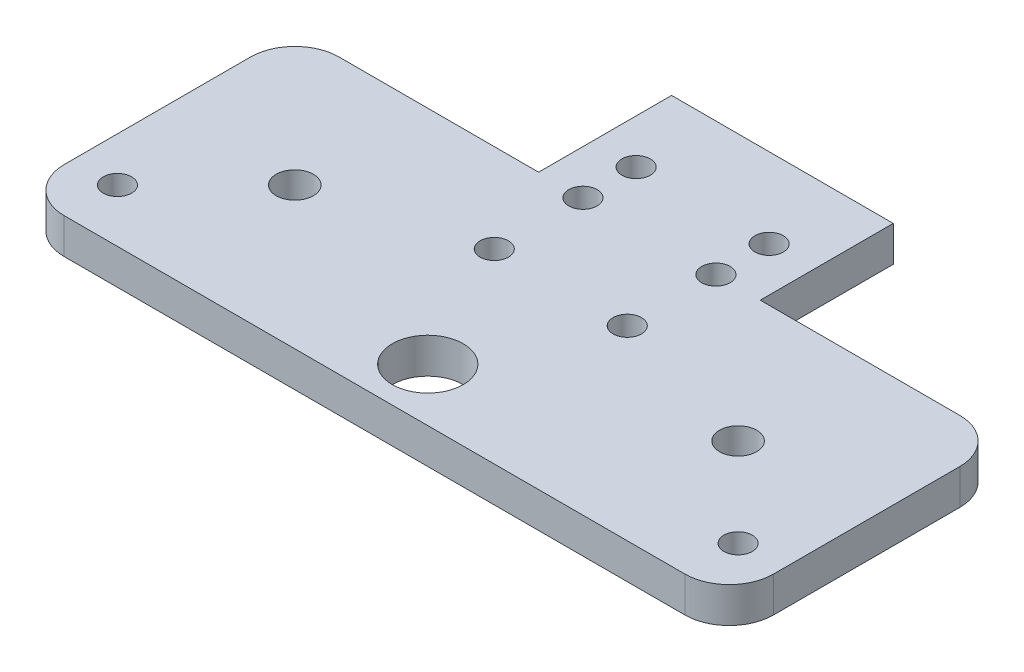
ISO-10303-21;
HEADER;
FILE_DESCRIPTION(('STEP AP214'),'2;1');
FILE_NAME('part.step','',(''),(''),'','','');
FILE_SCHEMA(('AUTOMOTIVE_DESIGN { 1 0 10303 214 1 1 1 1 }'));
ENDSEC;
DATA;
#1=APPLICATION_CONTEXT('core data for automotive mechanical design processes');
#2=APPLICATION_PROTOCOL_DEFINITION('international standard','automotive_design',2000,#1);
#3=PRODUCT_CONTEXT('',#1,'mechanical');
#4=PRODUCT('Part','Part','',(#3));
#5=PRODUCT_RELATED_PRODUCT_CATEGORY('part','',(#4));
#6=PRODUCT_DEFINITION_FORMATION('','',#4);
#7=PRODUCT_DEFINITION_CONTEXT('part definition',#1,'design');
#8=PRODUCT_DEFINITION('design','',#6,#7);
#9=PRODUCT_DEFINITION_SHAPE('','',#8);
#10=(LENGTH_UNIT() NAMED_UNIT(*) SI_UNIT(.MILLI.,.METRE.));
#11=(NAMED_UNIT(*) PLANE_ANGLE_UNIT() SI_UNIT($,.RADIAN.));
#12=(NAMED_UNIT(*) SI_UNIT($,.STERADIAN.) SOLID_ANGLE_UNIT());
#13=UNCERTAINTY_MEASURE_WITH_UNIT(LENGTH_MEASURE(1.E-05),#10,'distance_accuracy_value','');
#14=(GEOMETRIC_REPRESENTATION_CONTEXT(3) GLOBAL_UNCERTAINTY_ASSIGNED_CONTEXT((#13)) GLOBAL_UNIT_ASSIGNED_CONTEXT((#10,
#11,#12)) REPRESENTATION_CONTEXT('',''));
#15=CARTESIAN_POINT('',(0.,0.,0.));
#16=DIRECTION('',(0.,0.,1.));
#17=DIRECTION('',(1.,0.,0.));
#18=AXIS2_PLACEMENT_3D('',#15,#16,#17);
#19=CARTESIAN_POINT('',(-35.,4.,21.));
#20=DIRECTION('',(0.,1.,0.));
#21=DIRECTION('',(0.,0.,1.));
#22=AXIS2_PLACEMENT_3D('',#19,#20,#21);
#23=PLANE('',#22);
#24=CARTESIAN_POINT('',(-25.,4.,10.));
#25=DIRECTION('',(0.,1.,0.));
#26=DIRECTION('',(0.,0.,1.));
#27=AXIS2_PLACEMENT_3D('',#24,#25,#26);
#28=CIRCLE('',#27,2.1);
#29=CARTESIAN_POINT('',(-25.,4.,12.1));
#30=VERTEX_POINT('',#29);
#31=EDGE_CURVE('E319',#30,#30,#28,.T.);
#32=ORIENTED_EDGE('',*,*,#31,.F.);
#33=EDGE_LOOP('',(#32));
#34=FACE_BOUND('',#33,.T.);
#35=CARTESIAN_POINT('',(35.,4.,20.));
#36=DIRECTION('',(0.,1.,0.));
#37=DIRECTION('',(0.,0.,1.));
#38=AXIS2_PLACEMENT_3D('',#35,#36,#37);
#39=CIRCLE('',#38,1.6);
#40=CARTESIAN_POINT('',(35.,4.,21.6));
#41=VERTEX_POINT('',#40);
#42=EDGE_CURVE('E331',#41,#41,#39,.T.);
#43=ORIENTED_EDGE('',*,*,#42,.F.);
#44=EDGE_LOOP('',(#43));
#45=FACE_BOUND('',#44,.T.);
#46=CARTESIAN_POINT('',(7.5,4.,-5.));
#47=DIRECTION('',(0.,1.,0.));
#48=DIRECTION('',(0.,0.,1.));
#49=AXIS2_PLACEMENT_3D('',#46,#47,#48);
#50=CIRCLE('',#49,1.6);
#51=CARTESIAN_POINT('',(7.5,4.,-3.4));
#52=VERTEX_POINT('',#51);
#53=EDGE_CURVE('E343',#52,#52,#50,.T.);
#54=ORIENTED_EDGE('',*,*,#53,.F.);
#55=EDGE_LOOP('',(#54));
#56=FACE_BOUND('',#55,.T.);
#57=CARTESIAN_POINT('',(7.5,4.,5.));
#58=DIRECTION('',(0.,1.,0.));
#59=DIRECTION('',(0.,0.,1.));
#60=AXIS2_PLACEMENT_3D('',#57,#58,#59);
#61=CIRCLE('',#60,1.6);
#62=CARTESIAN_POINT('',(7.5,4.,6.6));
#63=VERTEX_POINT('',#62);
#64=EDGE_CURVE('E355',#63,#63,#61,.T.);
#65=ORIENTED_EDGE('',*,*,#64,.F.);
#66=EDGE_LOOP('',(#65));
#67=FACE_BOUND('',#66,.T.);
#68=CARTESIAN_POINT('',(7.5,4.,-11.));
#69=DIRECTION('',(0.,1.,0.));
#70=DIRECTION('',(0.,0.,1.));
#71=AXIS2_PLACEMENT_3D('',#68,#69,#70);
#72=CIRCLE('',#71,1.6);
#73=CARTESIAN_POINT('',(7.5,4.,-9.4));
#74=VERTEX_POINT('',#73);
#75=EDGE_CURVE('E367',#74,#74,#72,.T.);
#76=ORIENTED_EDGE('',*,*,#75,.F.);
#77=EDGE_LOOP('',(#76));
#78=FACE_BOUND('',#77,.T.);
#79=CARTESIAN_POINT('',(-35.,4.,21.));
#80=DIRECTION('',(0.,1.,0.));
#81=DIRECTION('',(0.,0.,1.));
#82=AXIS2_PLACEMENT_3D('',#79,#80,#81);
#83=CIRCLE('',#82,5.);
#84=CARTESIAN_POINT('',(-40.,4.,21.));
#85=VERTEX_POINT('',#84);
#86=CARTESIAN_POINT('',(-35.,4.,26.));
#87=VERTEX_POINT('',#86);
#88=EDGE_CURVE('E177',#85,#87,#83,.T.);
#89=ORIENTED_EDGE('',*,*,#88,.T.);
#90=DIRECTION('',(1.,0.,0.));
#91=VECTOR('',#90,1.);
#92=CARTESIAN_POINT('',(-35.,4.,26.));
#93=LINE('',#92,#91);
#94=CARTESIAN_POINT('',(35.,4.,26.));
#95=VERTEX_POINT('',#94);
#96=EDGE_CURVE('E105',#87,#95,#93,.T.);
#97=ORIENTED_EDGE('',*,*,#96,.T.);
#98=CARTESIAN_POINT('',(35.,4.,21.));
#99=DIRECTION('',(0.,1.,0.));
#100=DIRECTION('',(0.,0.,1.));
#101=AXIS2_PLACEMENT_3D('',#98,#99,#100);
#102=CIRCLE('',#101,5.);
#103=CARTESIAN_POINT('',(40.,4.,21.));
#104=VERTEX_POINT('',#103);
#105=EDGE_CURVE('E204',#95,#104,#102,.T.);
#106=ORIENTED_EDGE('',*,*,#105,.T.);
#107=DIRECTION('',(0.,0.,-1.));
#108=VECTOR('',#107,1.);
#109=CARTESIAN_POINT('',(40.,4.,21.));
#110=LINE('',#109,#108);
#111=CARTESIAN_POINT('',(40.,4.,0.));
#112=VERTEX_POINT('',#111);
#113=EDGE_CURVE('E223',#104,#112,#110,.T.);
#114=ORIENTED_EDGE('',*,*,#113,.T.);
#115=CARTESIAN_POINT('',(35.,4.,0.));
#116=DIRECTION('',(0.,1.,0.));
#117=DIRECTION('',(0.,0.,1.));
#118=AXIS2_PLACEMENT_3D('',#115,#116,#117);
#119=CIRCLE('',#118,5.);
#120=CARTESIAN_POINT('',(35.,4.,-5.));
#121=VERTEX_POINT('',#120);
#122=EDGE_CURVE('E220',#112,#121,#119,.T.);
#123=ORIENTED_EDGE('',*,*,#122,.T.);
#124=DIRECTION('',(-1.,0.,0.));
#125=VECTOR('',#124,1.);
#126=CARTESIAN_POINT('',(35.,4.,-5.));
#127=LINE('',#126,#125);
#128=CARTESIAN_POINT('',(12.5,4.,-5.));
#129=VERTEX_POINT('',#128);
#130=EDGE_CURVE('E222',#121,#129,#127,.T.);
#131=ORIENTED_EDGE('',*,*,#130,.T.);
#132=DIRECTION('',(0.,0.,-1.));
#133=VECTOR('',#132,1.);
#134=CARTESIAN_POINT('',(12.5,4.,-5.));
#135=LINE('',#134,#133);
#136=CARTESIAN_POINT('',(12.5,4.,-20.));
#137=VERTEX_POINT('',#136);
#138=EDGE_CURVE('E225',#129,#137,#135,.T.);
#139=ORIENTED_EDGE('',*,*,#138,.T.);
#140=DIRECTION('',(-1.,0.,0.));
#141=VECTOR('',#140,1.);
#142=CARTESIAN_POINT('',(12.5,4.,-20.));
#143=LINE('',#142,#141);
#144=CARTESIAN_POINT('',(-12.5,4.,-20.));
#145=VERTEX_POINT('',#144);
#146=EDGE_CURVE('E231',#137,#145,#143,.T.);
#147=ORIENTED_EDGE('',*,*,#146,.T.);
#148=DIRECTION('',(0.,0.,1.));
#149=VECTOR('',#148,1.);
#150=CARTESIAN_POINT('',(-12.5,4.,-20.));
#151=LINE('',#150,#149);
#152=CARTESIAN_POINT('',(-12.5,4.,-5.));
#153=VERTEX_POINT('',#152);
#154=EDGE_CURVE('E136',#145,#153,#151,.T.);
#155=ORIENTED_EDGE('',*,*,#154,.T.);
#156=DIRECTION('',(-1.,0.,0.));
#157=VECTOR('',#156,1.);
#158=CARTESIAN_POINT('',(-12.5,4.,-5.));
#159=LINE('',#158,#157);
#160=CARTESIAN_POINT('',(-35.,4.,-5.));
#161=VERTEX_POINT('',#160);
#162=EDGE_CURVE('E130',#153,#161,#159,.T.);
#163=ORIENTED_EDGE('',*,*,#162,.T.);
#164=CARTESIAN_POINT('',(-35.,4.,0.));
#165=DIRECTION('',(0.,1.,0.));
#166=DIRECTION('',(0.,0.,1.));
#167=AXIS2_PLACEMENT_3D('',#164,#165,#166);
#168=CIRCLE('',#167,5.);
#169=CARTESIAN_POINT('',(-40.,4.,0.));
#170=VERTEX_POINT('',#169);
#171=EDGE_CURVE('E134',#161,#170,#168,.T.);
#172=ORIENTED_EDGE('',*,*,#171,.T.);
#173=DIRECTION('',(0.,0.,1.));
#174=VECTOR('',#173,1.);
#175=CARTESIAN_POINT('',(-40.,4.,0.));
#176=LINE('',#175,#174);
#177=EDGE_CURVE('E50',#170,#85,#176,.T.);
#178=ORIENTED_EDGE('',*,*,#177,.T.);
#179=EDGE_LOOP('',(#89,#97,#106,#114,#123,#131,#139,#147,#155,#163,#172,#178));
#180=FACE_BOUND('',#179,.T.);
#181=CARTESIAN_POINT('',(-7.5,4.,-11.));
#182=DIRECTION('',(0.,1.,0.));
#183=DIRECTION('',(0.,0.,1.));
#184=AXIS2_PLACEMENT_3D('',#181,#182,#183);
#185=CIRCLE('',#184,1.6);
#186=CARTESIAN_POINT('',(-7.5,4.,-9.4));
#187=VERTEX_POINT('',#186);
#188=EDGE_CURVE('E158',#187,#187,#185,.T.);
#189=ORIENTED_EDGE('',*,*,#188,.F.);
#190=EDGE_LOOP('',(#189));
#191=FACE_BOUND('',#190,.T.);
#192=CARTESIAN_POINT('',(-7.5,4.,5.));
#193=DIRECTION('',(0.,1.,0.));
#194=DIRECTION('',(0.,0.,1.));
#195=AXIS2_PLACEMENT_3D('',#192,#193,#194);
#196=CIRCLE('',#195,1.6);
#197=CARTESIAN_POINT('',(-7.5,4.,6.6));
#198=VERTEX_POINT('',#197);
#199=EDGE_CURVE('E361',#198,#198,#196,.T.);
#200=ORIENTED_EDGE('',*,*,#199,.F.);
#201=EDGE_LOOP('',(#200));
#202=FACE_BOUND('',#201,.T.);
#203=CARTESIAN_POINT('',(-7.5,4.,-5.));
#204=DIRECTION('',(0.,1.,0.));
#205=DIRECTION('',(0.,0.,1.));
#206=AXIS2_PLACEMENT_3D('',#203,#204,#205);
#207=CIRCLE('',#206,1.6);
#208=CARTESIAN_POINT('',(-7.5,4.,-3.4));
#209=VERTEX_POINT('',#208);
#210=EDGE_CURVE('E349',#209,#209,#207,.T.);
#211=ORIENTED_EDGE('',*,*,#210,.F.);
#212=EDGE_LOOP('',(#211));
#213=FACE_BOUND('',#212,.T.);
#214=CARTESIAN_POINT('',(-35.,4.,20.));
#215=DIRECTION('',(0.,1.,0.));
#216=DIRECTION('',(0.,0.,1.));
#217=AXIS2_PLACEMENT_3D('',#214,#215,#216);
#218=CIRCLE('',#217,1.6);
#219=CARTESIAN_POINT('',(-35.,4.,21.6));
#220=VERTEX_POINT('',#219);
#221=EDGE_CURVE('E337',#220,#220,#218,.T.);
#222=ORIENTED_EDGE('',*,*,#221,.F.);
#223=EDGE_LOOP('',(#222));
#224=FACE_BOUND('',#223,.T.);
#225=CARTESIAN_POINT('',(25.,4.,10.));
#226=DIRECTION('',(0.,1.,0.));
#227=DIRECTION('',(0.,0.,-1.));
#228=AXIS2_PLACEMENT_3D('',#225,#226,#227);
#229=CIRCLE('',#228,2.1);
#230=CARTESIAN_POINT('',(25.,4.,7.9));
#231=VERTEX_POINT('',#230);
#232=EDGE_CURVE('E325',#231,#231,#229,.T.);
#233=ORIENTED_EDGE('',*,*,#232,.F.);
#234=EDGE_LOOP('',(#233));
#235=FACE_BOUND('',#234,.T.);
#236=CARTESIAN_POINT('',(0.,4.,20.));
#237=DIRECTION('',(0.,1.,0.));
#238=DIRECTION('',(0.,0.,1.));
#239=AXIS2_PLACEMENT_3D('',#236,#237,#238);
#240=CIRCLE('',#239,4.);
#241=CARTESIAN_POINT('',(0.,4.,24.));
#242=VERTEX_POINT('',#241);
#243=EDGE_CURVE('E310',#242,#242,#240,.T.);
#244=ORIENTED_EDGE('',*,*,#243,.F.);
#245=EDGE_LOOP('',(#244));
#246=FACE_BOUND('',#245,.T.);
#247=ADVANCED_FACE('F33',(#34,#45,#56,#67,#78,#180,#191,#202,#213,#224,#235,#246),#23,.T.);
#248=CARTESIAN_POINT('',(-35.,0.,21.));
#249=DIRECTION('',(0.,1.,0.));
#250=DIRECTION('',(0.,0.,1.));
#251=AXIS2_PLACEMENT_3D('',#248,#249,#250);
#252=PLANE('',#251);
#253=CARTESIAN_POINT('',(-35.,0.,21.));
#254=DIRECTION('',(0.,1.,0.));
#255=DIRECTION('',(0.,0.,1.));
#256=AXIS2_PLACEMENT_3D('',#253,#254,#255);
#257=CIRCLE('',#256,5.);
#258=CARTESIAN_POINT('',(-40.,0.,21.));
#259=VERTEX_POINT('',#258);
#260=CARTESIAN_POINT('',(-35.,0.,26.));
#261=VERTEX_POINT('',#260);
#262=EDGE_CURVE('E154',#259,#261,#257,.T.);
#263=ORIENTED_EDGE('',*,*,#262,.F.);
#264=DIRECTION('',(0.,0.,1.));
#265=VECTOR('',#264,1.);
#266=CARTESIAN_POINT('',(-40.,0.,0.));
#267=LINE('',#266,#265);
#268=CARTESIAN_POINT('',(-40.,0.,0.));
#269=VERTEX_POINT('',#268);
#270=EDGE_CURVE('E97',#269,#259,#267,.T.);
#271=ORIENTED_EDGE('',*,*,#270,.F.);
#272=CARTESIAN_POINT('',(-35.,0.,0.));
#273=DIRECTION('',(0.,1.,0.));
#274=DIRECTION('',(0.,0.,1.));
#275=AXIS2_PLACEMENT_3D('',#272,#273,#274);
#276=CIRCLE('',#275,5.);
#277=CARTESIAN_POINT('',(-35.,0.,-5.));
#278=VERTEX_POINT('',#277);
#279=EDGE_CURVE('E91',#278,#269,#276,.T.);
#280=ORIENTED_EDGE('',*,*,#279,.F.);
#281=DIRECTION('',(-1.,0.,0.));
#282=VECTOR('',#281,1.);
#283=CARTESIAN_POINT('',(-12.5,0.,-5.));
#284=LINE('',#283,#282);
#285=CARTESIAN_POINT('',(-12.5,0.,-5.));
#286=VERTEX_POINT('',#285);
#287=EDGE_CURVE('E144',#286,#278,#284,.T.);
#288=ORIENTED_EDGE('',*,*,#287,.F.);
#289=DIRECTION('',(0.,0.,1.));
#290=VECTOR('',#289,1.);
#291=CARTESIAN_POINT('',(-12.5,0.,-20.));
#292=LINE('',#291,#290);
#293=CARTESIAN_POINT('',(-12.5,0.,-20.));
#294=VERTEX_POINT('',#293);
#295=EDGE_CURVE('E172',#294,#286,#292,.T.);
#296=ORIENTED_EDGE('',*,*,#295,.F.);
#297=DIRECTION('',(-1.,0.,0.));
#298=VECTOR('',#297,1.);
#299=CARTESIAN_POINT('',(12.5,0.,-20.));
#300=LINE('',#299,#298);
#301=CARTESIAN_POINT('',(12.5,0.,-20.));
#302=VERTEX_POINT('',#301);
#303=EDGE_CURVE('E170',#302,#294,#300,.T.);
#304=ORIENTED_EDGE('',*,*,#303,.F.);
#305=DIRECTION('',(0.,0.,-1.));
#306=VECTOR('',#305,1.);
#307=CARTESIAN_POINT('',(12.5,0.,-5.));
#308=LINE('',#307,#306);
#309=CARTESIAN_POINT('',(12.5,0.,-5.));
#310=VERTEX_POINT('',#309);
#311=EDGE_CURVE('E168',#310,#302,#308,.T.);
#312=ORIENTED_EDGE('',*,*,#311,.F.);
#313=DIRECTION('',(-1.,0.,0.));
#314=VECTOR('',#313,1.);
#315=CARTESIAN_POINT('',(35.,0.,-5.));
#316=LINE('',#315,#314);
#317=CARTESIAN_POINT('',(35.,0.,-5.));
#318=VERTEX_POINT('',#317);
#319=EDGE_CURVE('E166',#318,#310,#316,.T.);
#320=ORIENTED_EDGE('',*,*,#319,.F.);
#321=CARTESIAN_POINT('',(35.,0.,0.));
#322=DIRECTION('',(0.,1.,0.));
#323=DIRECTION('',(0.,0.,1.));
#324=AXIS2_PLACEMENT_3D('',#321,#322,#323);
#325=CIRCLE('',#324,5.);
#326=CARTESIAN_POINT('',(40.,0.,0.));
#327=VERTEX_POINT('',#326);
#328=EDGE_CURVE('E164',#327,#318,#325,.T.);
#329=ORIENTED_EDGE('',*,*,#328,.F.);
#330=DIRECTION('',(0.,0.,-1.));
#331=VECTOR('',#330,1.);
#332=CARTESIAN_POINT('',(40.,0.,21.));
#333=LINE('',#332,#331);
#334=CARTESIAN_POINT('',(40.,0.,21.));
#335=VERTEX_POINT('',#334);
#336=EDGE_CURVE('E162',#335,#327,#333,.T.);
#337=ORIENTED_EDGE('',*,*,#336,.F.);
#338=CARTESIAN_POINT('',(35.,0.,21.));
#339=DIRECTION('',(0.,1.,0.));
#340=DIRECTION('',(0.,0.,1.));
#341=AXIS2_PLACEMENT_3D('',#338,#339,#340);
#342=CIRCLE('',#341,5.);
#343=CARTESIAN_POINT('',(35.,0.,26.));
#344=VERTEX_POINT('',#343);
#345=EDGE_CURVE('E160',#344,#335,#342,.T.);
#346=ORIENTED_EDGE('',*,*,#345,.F.);
#347=DIRECTION('',(1.,0.,0.));
#348=VECTOR('',#347,1.);
#349=CARTESIAN_POINT('',(-35.,0.,26.));
#350=LINE('',#349,#348);
#351=EDGE_CURVE('E157',#261,#344,#350,.T.);
#352=ORIENTED_EDGE('',*,*,#351,.F.);
#353=EDGE_LOOP('',(#263,#271,#280,#288,#296,#304,#312,#320,#329,#337,#346,#352));
#354=FACE_BOUND('',#353,.T.);
#355=CARTESIAN_POINT('',(-7.5,0.,-11.));
#356=DIRECTION('',(0.,1.,0.));
#357=DIRECTION('',(0.,0.,1.));
#358=AXIS2_PLACEMENT_3D('',#355,#356,#357);
#359=CIRCLE('',#358,1.6);
#360=CARTESIAN_POINT('',(-7.5,0.,-9.4));
#361=VERTEX_POINT('',#360);
#362=EDGE_CURVE('E370',#361,#361,#359,.T.);
#363=ORIENTED_EDGE('',*,*,#362,.T.);
#364=EDGE_LOOP('',(#363));
#365=FACE_BOUND('',#364,.T.);
#366=CARTESIAN_POINT('',(7.5,0.,-11.));
#367=DIRECTION('',(0.,1.,0.));
#368=DIRECTION('',(0.,0.,1.));
#369=AXIS2_PLACEMENT_3D('',#366,#367,#368);
#370=CIRCLE('',#369,1.6);
#371=CARTESIAN_POINT('',(7.5,0.,-9.4));
#372=VERTEX_POINT('',#371);
#373=EDGE_CURVE('E364',#372,#372,#370,.T.);
#374=ORIENTED_EDGE('',*,*,#373,.T.);
#375=EDGE_LOOP('',(#374));
#376=FACE_BOUND('',#375,.T.);
#377=CARTESIAN_POINT('',(-7.5,0.,5.));
#378=DIRECTION('',(0.,1.,0.));
#379=DIRECTION('',(0.,0.,1.));
#380=AXIS2_PLACEMENT_3D('',#377,#378,#379);
#381=CIRCLE('',#380,1.6);
#382=CARTESIAN_POINT('',(-7.5,0.,6.6));
#383=VERTEX_POINT('',#382);
#384=EDGE_CURVE('E358',#383,#383,#381,.T.);
#385=ORIENTED_EDGE('',*,*,#384,.T.);
#386=EDGE_LOOP('',(#385));
#387=FACE_BOUND('',#386,.T.);
#388=CARTESIAN_POINT('',(7.5,0.,5.));
#389=DIRECTION('',(0.,1.,0.));
#390=DIRECTION('',(0.,0.,1.));
#391=AXIS2_PLACEMENT_3D('',#388,#389,#390);
#392=CIRCLE('',#391,1.6);
#393=CARTESIAN_POINT('',(7.5,0.,6.6));
#394=VERTEX_POINT('',#393);
#395=EDGE_CURVE('E352',#394,#394,#392,.T.);
#396=ORIENTED_EDGE('',*,*,#395,.T.);
#397=EDGE_LOOP('',(#396));
#398=FACE_BOUND('',#397,.T.);
#399=CARTESIAN_POINT('',(-7.5,0.,-5.));
#400=DIRECTION('',(0.,1.,0.));
#401=DIRECTION('',(0.,0.,1.));
#402=AXIS2_PLACEMENT_3D('',#399,#400,#401);
#403=CIRCLE('',#402,1.6);
#404=CARTESIAN_POINT('',(-7.5,0.,-3.4));
#405=VERTEX_POINT('',#404);
#406=EDGE_CURVE('E346',#405,#405,#403,.T.);
#407=ORIENTED_EDGE('',*,*,#406,.T.);
#408=EDGE_LOOP('',(#407));
#409=FACE_BOUND('',#408,.T.);
#410=CARTESIAN_POINT('',(7.5,0.,-5.));
#411=DIRECTION('',(0.,1.,0.));
#412=DIRECTION('',(0.,0.,1.));
#413=AXIS2_PLACEMENT_3D('',#410,#411,#412);
#414=CIRCLE('',#413,1.6);
#415=CARTESIAN_POINT('',(7.5,0.,-3.4));
#416=VERTEX_POINT('',#415);
#417=EDGE_CURVE('E340',#416,#416,#414,.T.);
#418=ORIENTED_EDGE('',*,*,#417,.T.);
#419=EDGE_LOOP('',(#418));
#420=FACE_BOUND('',#419,.T.);
#421=CARTESIAN_POINT('',(-35.,0.,20.));
#422=DIRECTION('',(0.,1.,0.));
#423=DIRECTION('',(0.,0.,1.));
#424=AXIS2_PLACEMENT_3D('',#421,#422,#423);
#425=CIRCLE('',#424,1.6);
#426=CARTESIAN_POINT('',(-35.,0.,21.6));
#427=VERTEX_POINT('',#426);
#428=EDGE_CURVE('E334',#427,#427,#425,.T.);
#429=ORIENTED_EDGE('',*,*,#428,.T.);
#430=EDGE_LOOP('',(#429));
#431=FACE_BOUND('',#430,.T.);
#432=CARTESIAN_POINT('',(35.,0.,20.));
#433=DIRECTION('',(0.,1.,0.));
#434=DIRECTION('',(0.,0.,1.));
#435=AXIS2_PLACEMENT_3D('',#432,#433,#434);
#436=CIRCLE('',#435,1.6);
#437=CARTESIAN_POINT('',(35.,0.,21.6));
#438=VERTEX_POINT('',#437);
#439=EDGE_CURVE('E328',#438,#438,#436,.T.);
#440=ORIENTED_EDGE('',*,*,#439,.T.);
#441=EDGE_LOOP('',(#440));
#442=FACE_BOUND('',#441,.T.);
#443=CARTESIAN_POINT('',(25.,0.,10.));
#444=DIRECTION('',(0.,1.,0.));
#445=DIRECTION('',(0.,0.,-1.));
#446=AXIS2_PLACEMENT_3D('',#443,#444,#445);
#447=CIRCLE('',#446,2.1);
#448=CARTESIAN_POINT('',(25.,0.,7.9));
#449=VERTEX_POINT('',#448);
#450=EDGE_CURVE('E322',#449,#449,#447,.T.);
#451=ORIENTED_EDGE('',*,*,#450,.T.);
#452=EDGE_LOOP('',(#451));
#453=FACE_BOUND('',#452,.T.);
#454=CARTESIAN_POINT('',(-25.,0.,10.));
#455=DIRECTION('',(0.,1.,0.));
#456=DIRECTION('',(0.,0.,1.));
#457=AXIS2_PLACEMENT_3D('',#454,#455,#456);
#458=CIRCLE('',#457,2.1);
#459=CARTESIAN_POINT('',(-25.,0.,12.1));
#460=VERTEX_POINT('',#459);
#461=EDGE_CURVE('E316',#460,#460,#458,.T.);
#462=ORIENTED_EDGE('',*,*,#461,.T.);
#463=EDGE_LOOP('',(#462));
#464=FACE_BOUND('',#463,.T.);
#465=CARTESIAN_POINT('',(0.,0.,20.));
#466=DIRECTION('',(0.,1.,0.));
#467=DIRECTION('',(0.,0.,1.));
#468=AXIS2_PLACEMENT_3D('',#465,#466,#467);
#469=CIRCLE('',#468,4.);
#470=CARTESIAN_POINT('',(0.,0.,24.));
#471=VERTEX_POINT('',#470);
#472=EDGE_CURVE('E313',#471,#471,#469,.T.);
#473=ORIENTED_EDGE('',*,*,#472,.T.);
#474=EDGE_LOOP('',(#473));
#475=FACE_BOUND('',#474,.T.);
#476=ADVANCED_FACE('F208',(#354,#365,#376,#387,#398,#409,#420,#431,#442,#453,#464,#475),#252,.F.);
#477=CARTESIAN_POINT('',(-35.,4.,21.));
#478=DIRECTION('',(0.,-1.,0.));
#479=DIRECTION('',(0.,0.,-1.));
#480=AXIS2_PLACEMENT_3D('',#477,#478,#479);
#481=CYLINDRICAL_SURFACE('',#480,5.);
#482=ORIENTED_EDGE('',*,*,#262,.T.);
#483=DIRECTION('',(0.,-1.,0.));
#484=VECTOR('',#483,1.);
#485=CARTESIAN_POINT('',(-35.,4.,26.));
#486=LINE('',#485,#484);
#487=EDGE_CURVE('E11',#87,#261,#486,.T.);
#488=ORIENTED_EDGE('',*,*,#487,.F.);
#489=ORIENTED_EDGE('',*,*,#88,.F.);
#490=DIRECTION('',(0.,-1.,0.));
#491=VECTOR('',#490,1.);
#492=CARTESIAN_POINT('',(-40.,4.,21.));
#493=LINE('',#492,#491);
#494=EDGE_CURVE('E150',#85,#259,#493,.T.);
#495=ORIENTED_EDGE('',*,*,#494,.T.);
#496=EDGE_LOOP('',(#482,#488,#489,#495));
#497=FACE_BOUND('',#496,.T.);
#498=ADVANCED_FACE('F35',(#497),#481,.T.);
#499=CARTESIAN_POINT('',(-35.,4.,26.));
#500=DIRECTION('',(0.,0.,-1.));
#501=DIRECTION('',(-1.,0.,0.));
#502=AXIS2_PLACEMENT_3D('',#499,#500,#501);
#503=PLANE('',#502);
#504=ORIENTED_EDGE('',*,*,#351,.T.);
#505=DIRECTION('',(0.,-1.,0.));
#506=VECTOR('',#505,1.);
#507=CARTESIAN_POINT('',(35.,4.,26.));
#508=LINE('',#507,#506);
#509=EDGE_CURVE('E42',#95,#344,#508,.T.);
#510=ORIENTED_EDGE('',*,*,#509,.F.);
#511=ORIENTED_EDGE('',*,*,#96,.F.);
#512=ORIENTED_EDGE('',*,*,#487,.T.);
#513=EDGE_LOOP('',(#504,#510,#511,#512));
#514=FACE_BOUND('',#513,.T.);
#515=ADVANCED_FACE('F543',(#514),#503,.F.);
#516=CARTESIAN_POINT('',(35.,4.,21.));
#517=DIRECTION('',(0.,-1.,0.));
#518=DIRECTION('',(0.,0.,-1.));
#519=AXIS2_PLACEMENT_3D('',#516,#517,#518);
#520=CYLINDRICAL_SURFACE('',#519,5.);
#521=ORIENTED_EDGE('',*,*,#345,.T.);
#522=DIRECTION('',(0.,-1.,0.));
#523=VECTOR('',#522,1.);
#524=CARTESIAN_POINT('',(40.,4.,21.));
#525=LINE('',#524,#523);
#526=EDGE_CURVE('E196',#104,#335,#525,.T.);
#527=ORIENTED_EDGE('',*,*,#526,.F.);
#528=ORIENTED_EDGE('',*,*,#105,.F.);
#529=ORIENTED_EDGE('',*,*,#509,.T.);
#530=EDGE_LOOP('',(#521,#527,#528,#529));
#531=FACE_BOUND('',#530,.T.);
#532=ADVANCED_FACE('F202',(#531),#520,.T.);
#533=CARTESIAN_POINT('',(40.,4.,21.));
#534=DIRECTION('',(-1.,0.,0.));
#535=DIRECTION('',(0.,0.,1.));
#536=AXIS2_PLACEMENT_3D('',#533,#534,#535);
#537=PLANE('',#536);
#538=ORIENTED_EDGE('',*,*,#336,.T.);
#539=DIRECTION('',(0.,-1.,0.));
#540=VECTOR('',#539,1.);
#541=CARTESIAN_POINT('',(40.,4.,0.));
#542=LINE('',#541,#540);
#543=EDGE_CURVE('E193',#112,#327,#542,.T.);
#544=ORIENTED_EDGE('',*,*,#543,.F.);
#545=ORIENTED_EDGE('',*,*,#113,.F.);
#546=ORIENTED_EDGE('',*,*,#526,.T.);
#547=EDGE_LOOP('',(#538,#544,#545,#546));
#548=FACE_BOUND('',#547,.T.);
#549=ADVANCED_FACE('F214',(#548),#537,.F.);
#550=CARTESIAN_POINT('',(35.,4.,0.));
#551=DIRECTION('',(0.,-1.,0.));
#552=DIRECTION('',(0.,0.,-1.));
#553=AXIS2_PLACEMENT_3D('',#550,#551,#552);
#554=CYLINDRICAL_SURFACE('',#553,5.);
#555=ORIENTED_EDGE('',*,*,#328,.T.);
#556=DIRECTION('',(0.,-1.,0.));
#557=VECTOR('',#556,1.);
#558=CARTESIAN_POINT('',(35.,4.,-5.));
#559=LINE('',#558,#557);
#560=EDGE_CURVE('E190',#121,#318,#559,.T.);
#561=ORIENTED_EDGE('',*,*,#560,.F.);
#562=ORIENTED_EDGE('',*,*,#122,.F.);
#563=ORIENTED_EDGE('',*,*,#543,.T.);
#564=EDGE_LOOP('',(#555,#561,#562,#563));
#565=FACE_BOUND('',#564,.T.);
#566=ADVANCED_FACE('F218',(#565),#554,.T.);
#567=CARTESIAN_POINT('',(35.,4.,-5.));
#568=DIRECTION('',(0.,0.,1.));
#569=DIRECTION('',(1.,0.,0.));
#570=AXIS2_PLACEMENT_3D('',#567,#568,#569);
#571=PLANE('',#570);
#572=ORIENTED_EDGE('',*,*,#319,.T.);
#573=DIRECTION('',(0.,-1.,0.));
#574=VECTOR('',#573,1.);
#575=CARTESIAN_POINT('',(12.5,4.,-5.));
#576=LINE('',#575,#574);
#577=EDGE_CURVE('E187',#129,#310,#576,.T.);
#578=ORIENTED_EDGE('',*,*,#577,.F.);
#579=ORIENTED_EDGE('',*,*,#130,.F.);
#580=ORIENTED_EDGE('',*,*,#560,.T.);
#581=EDGE_LOOP('',(#572,#578,#579,#580));
#582=FACE_BOUND('',#581,.T.);
#583=ADVANCED_FACE('F508',(#582),#571,.F.);
#584=CARTESIAN_POINT('',(12.5,4.,-5.));
#585=DIRECTION('',(-1.,0.,0.));
#586=DIRECTION('',(0.,0.,1.));
#587=AXIS2_PLACEMENT_3D('',#584,#585,#586);
#588=PLANE('',#587);
#589=ORIENTED_EDGE('',*,*,#311,.T.);
#590=DIRECTION('',(0.,-1.,0.));
#591=VECTOR('',#590,1.);
#592=CARTESIAN_POINT('',(12.5,4.,-20.));
#593=LINE('',#592,#591);
#594=EDGE_CURVE('E184',#137,#302,#593,.T.);
#595=ORIENTED_EDGE('',*,*,#594,.F.);
#596=ORIENTED_EDGE('',*,*,#138,.F.);
#597=ORIENTED_EDGE('',*,*,#577,.T.);
#598=EDGE_LOOP('',(#589,#595,#596,#597));
#599=FACE_BOUND('',#598,.T.);
#600=ADVANCED_FACE('F499',(#599),#588,.F.);
#601=CARTESIAN_POINT('',(12.5,4.,-20.));
#602=DIRECTION('',(0.,0.,1.));
#603=DIRECTION('',(1.,0.,0.));
#604=AXIS2_PLACEMENT_3D('',#601,#602,#603);
#605=PLANE('',#604);
#606=ORIENTED_EDGE('',*,*,#303,.T.);
#607=DIRECTION('',(0.,-1.,0.));
#608=VECTOR('',#607,1.);
#609=CARTESIAN_POINT('',(-12.5,4.,-20.));
#610=LINE('',#609,#608);
#611=EDGE_CURVE('E181',#145,#294,#610,.T.);
#612=ORIENTED_EDGE('',*,*,#611,.F.);
#613=ORIENTED_EDGE('',*,*,#146,.F.);
#614=ORIENTED_EDGE('',*,*,#594,.T.);
#615=EDGE_LOOP('',(#606,#612,#613,#614));
#616=FACE_BOUND('',#615,.T.);
#617=ADVANCED_FACE('F237',(#616),#605,.F.);
#618=CARTESIAN_POINT('',(-12.5,4.,-20.));
#619=DIRECTION('',(1.,0.,0.));
#620=DIRECTION('',(0.,0.,-1.));
#621=AXIS2_PLACEMENT_3D('',#618,#619,#620);
#622=PLANE('',#621);
#623=ORIENTED_EDGE('',*,*,#295,.T.);
#624=DIRECTION('',(0.,-1.,0.));
#625=VECTOR('',#624,1.);
#626=CARTESIAN_POINT('',(-12.5,4.,-5.));
#627=LINE('',#626,#625);
#628=EDGE_CURVE('E145',#153,#286,#627,.T.);
#629=ORIENTED_EDGE('',*,*,#628,.F.);
#630=ORIENTED_EDGE('',*,*,#154,.F.);
#631=ORIENTED_EDGE('',*,*,#611,.T.);
#632=EDGE_LOOP('',(#623,#629,#630,#631));
#633=FACE_BOUND('',#632,.T.);
#634=ADVANCED_FACE('F241',(#633),#622,.F.);
#635=CARTESIAN_POINT('',(-12.5,4.,-5.));
#636=DIRECTION('',(0.,0.,1.));
#637=DIRECTION('',(1.,0.,0.));
#638=AXIS2_PLACEMENT_3D('',#635,#636,#637);
#639=PLANE('',#638);
#640=ORIENTED_EDGE('',*,*,#287,.T.);
#641=DIRECTION('',(0.,-1.,0.));
#642=VECTOR('',#641,1.);
#643=CARTESIAN_POINT('',(-35.,4.,-5.));
#644=LINE('',#643,#642);
#645=EDGE_CURVE('E141',#161,#278,#644,.T.);
#646=ORIENTED_EDGE('',*,*,#645,.F.);
#647=ORIENTED_EDGE('',*,*,#162,.F.);
#648=ORIENTED_EDGE('',*,*,#628,.T.);
#649=EDGE_LOOP('',(#640,#646,#647,#648));
#650=FACE_BOUND('',#649,.T.);
#651=ADVANCED_FACE('F142',(#650),#639,.F.);
#652=CARTESIAN_POINT('',(-35.,4.,0.));
#653=DIRECTION('',(0.,-1.,0.));
#654=DIRECTION('',(0.,0.,-1.));
#655=AXIS2_PLACEMENT_3D('',#652,#653,#654);
#656=CYLINDRICAL_SURFACE('',#655,5.);
#657=ORIENTED_EDGE('',*,*,#279,.T.);
#658=DIRECTION('',(0.,-1.,0.));
#659=VECTOR('',#658,1.);
#660=CARTESIAN_POINT('',(-40.,4.,0.));
#661=LINE('',#660,#659);
#662=EDGE_CURVE('E146',#170,#269,#661,.T.);
#663=ORIENTED_EDGE('',*,*,#662,.F.);
#664=ORIENTED_EDGE('',*,*,#171,.F.);
#665=ORIENTED_EDGE('',*,*,#645,.T.);
#666=EDGE_LOOP('',(#657,#663,#664,#665));
#667=FACE_BOUND('',#666,.T.);
#668=ADVANCED_FACE('F148',(#667),#656,.T.);
#669=CARTESIAN_POINT('',(-40.,4.,0.));
#670=DIRECTION('',(1.,0.,0.));
#671=DIRECTION('',(0.,0.,-1.));
#672=AXIS2_PLACEMENT_3D('',#669,#670,#671);
#673=PLANE('',#672);
#674=ORIENTED_EDGE('',*,*,#270,.T.);
#675=ORIENTED_EDGE('',*,*,#494,.F.);
#676=ORIENTED_EDGE('',*,*,#177,.F.);
#677=ORIENTED_EDGE('',*,*,#662,.T.);
#678=EDGE_LOOP('',(#674,#675,#676,#677));
#679=FACE_BOUND('',#678,.T.);
#680=ADVANCED_FACE('F245',(#679),#673,.F.);
#681=CARTESIAN_POINT('',(-7.5,4.,-11.));
#682=DIRECTION('',(0.,-1.,0.));
#683=DIRECTION('',(0.,0.,-1.));
#684=AXIS2_PLACEMENT_3D('',#681,#682,#683);
#685=CYLINDRICAL_SURFACE('',#684,1.6);
#686=ORIENTED_EDGE('',*,*,#188,.T.);
#687=EDGE_LOOP('',(#686));
#688=FACE_BOUND('',#687,.T.);
#689=ORIENTED_EDGE('',*,*,#362,.F.);
#690=EDGE_LOOP('',(#689));
#691=FACE_BOUND('',#690,.T.);
#692=ADVANCED_FACE('F247',(#688,#691),#685,.F.);
#693=CARTESIAN_POINT('',(7.5,4.,-11.));
#694=DIRECTION('',(0.,-1.,0.));
#695=DIRECTION('',(0.,0.,-1.));
#696=AXIS2_PLACEMENT_3D('',#693,#694,#695);
#697=CYLINDRICAL_SURFACE('',#696,1.6);
#698=ORIENTED_EDGE('',*,*,#75,.T.);
#699=EDGE_LOOP('',(#698));
#700=FACE_BOUND('',#699,.T.);
#701=ORIENTED_EDGE('',*,*,#373,.F.);
#702=EDGE_LOOP('',(#701));
#703=FACE_BOUND('',#702,.T.);
#704=ADVANCED_FACE('F253',(#700,#703),#697,.F.);
#705=CARTESIAN_POINT('',(-7.5,4.,5.));
#706=DIRECTION('',(0.,-1.,0.));
#707=DIRECTION('',(0.,0.,-1.));
#708=AXIS2_PLACEMENT_3D('',#705,#706,#707);
#709=CYLINDRICAL_SURFACE('',#708,1.6);
#710=ORIENTED_EDGE('',*,*,#199,.T.);
#711=EDGE_LOOP('',(#710));
#712=FACE_BOUND('',#711,.T.);
#713=ORIENTED_EDGE('',*,*,#384,.F.);
#714=EDGE_LOOP('',(#713));
#715=FACE_BOUND('',#714,.T.);
#716=ADVANCED_FACE('F269',(#712,#715),#709,.F.);
#717=CARTESIAN_POINT('',(7.5,4.,5.));
#718=DIRECTION('',(0.,-1.,0.));
#719=DIRECTION('',(0.,0.,-1.));
#720=AXIS2_PLACEMENT_3D('',#717,#718,#719);
#721=CYLINDRICAL_SURFACE('',#720,1.6);
#722=ORIENTED_EDGE('',*,*,#64,.T.);
#723=EDGE_LOOP('',(#722));
#724=FACE_BOUND('',#723,.T.);
#725=ORIENTED_EDGE('',*,*,#395,.F.);
#726=EDGE_LOOP('',(#725));
#727=FACE_BOUND('',#726,.T.);
#728=ADVANCED_FACE('F273',(#724,#727),#721,.F.);
#729=CARTESIAN_POINT('',(-7.5,4.,-5.));
#730=DIRECTION('',(0.,-1.,0.));
#731=DIRECTION('',(0.,0.,-1.));
#732=AXIS2_PLACEMENT_3D('',#729,#730,#731);
#733=CYLINDRICAL_SURFACE('',#732,1.6);
#734=ORIENTED_EDGE('',*,*,#210,.T.);
#735=EDGE_LOOP('',(#734));
#736=FACE_BOUND('',#735,.T.);
#737=ORIENTED_EDGE('',*,*,#406,.F.);
#738=EDGE_LOOP('',(#737));
#739=FACE_BOUND('',#738,.T.);
#740=ADVANCED_FACE('F277',(#736,#739),#733,.F.);
#741=CARTESIAN_POINT('',(7.5,4.,-5.));
#742=DIRECTION('',(0.,-1.,0.));
#743=DIRECTION('',(0.,0.,-1.));
#744=AXIS2_PLACEMENT_3D('',#741,#742,#743);
#745=CYLINDRICAL_SURFACE('',#744,1.6);
#746=ORIENTED_EDGE('',*,*,#53,.T.);
#747=EDGE_LOOP('',(#746));
#748=FACE_BOUND('',#747,.T.);
#749=ORIENTED_EDGE('',*,*,#417,.F.);
#750=EDGE_LOOP('',(#749));
#751=FACE_BOUND('',#750,.T.);
#752=ADVANCED_FACE('F281',(#748,#751),#745,.F.);
#753=CARTESIAN_POINT('',(-35.,4.,20.));
#754=DIRECTION('',(0.,-1.,0.));
#755=DIRECTION('',(0.,0.,-1.));
#756=AXIS2_PLACEMENT_3D('',#753,#754,#755);
#757=CYLINDRICAL_SURFACE('',#756,1.6);
#758=ORIENTED_EDGE('',*,*,#221,.T.);
#759=EDGE_LOOP('',(#758));
#760=FACE_BOUND('',#759,.T.);
#761=ORIENTED_EDGE('',*,*,#428,.F.);
#762=EDGE_LOOP('',(#761));
#763=FACE_BOUND('',#762,.T.);
#764=ADVANCED_FACE('F285',(#760,#763),#757,.F.);
#765=CARTESIAN_POINT('',(35.,4.,20.));
#766=DIRECTION('',(0.,-1.,0.));
#767=DIRECTION('',(0.,0.,-1.));
#768=AXIS2_PLACEMENT_3D('',#765,#766,#767);
#769=CYLINDRICAL_SURFACE('',#768,1.6);
#770=ORIENTED_EDGE('',*,*,#42,.T.);
#771=EDGE_LOOP('',(#770));
#772=FACE_BOUND('',#771,.T.);
#773=ORIENTED_EDGE('',*,*,#439,.F.);
#774=EDGE_LOOP('',(#773));
#775=FACE_BOUND('',#774,.T.);
#776=ADVANCED_FACE('F289',(#772,#775),#769,.F.);
#777=CARTESIAN_POINT('',(25.,4.,10.));
#778=DIRECTION('',(0.,-1.,0.));
#779=DIRECTION('',(0.,0.,-1.));
#780=AXIS2_PLACEMENT_3D('',#777,#778,#779);
#781=CYLINDRICAL_SURFACE('',#780,2.1);
#782=ORIENTED_EDGE('',*,*,#232,.T.);
#783=EDGE_LOOP('',(#782));
#784=FACE_BOUND('',#783,.T.);
#785=ORIENTED_EDGE('',*,*,#450,.F.);
#786=EDGE_LOOP('',(#785));
#787=FACE_BOUND('',#786,.T.);
#788=ADVANCED_FACE('F293',(#784,#787),#781,.F.);
#789=CARTESIAN_POINT('',(-25.,4.,10.));
#790=DIRECTION('',(0.,-1.,0.));
#791=DIRECTION('',(0.,0.,-1.));
#792=AXIS2_PLACEMENT_3D('',#789,#790,#791);
#793=CYLINDRICAL_SURFACE('',#792,2.1);
#794=ORIENTED_EDGE('',*,*,#31,.T.);
#795=EDGE_LOOP('',(#794));
#796=FACE_BOUND('',#795,.T.);
#797=ORIENTED_EDGE('',*,*,#461,.F.);
#798=EDGE_LOOP('',(#797));
#799=FACE_BOUND('',#798,.T.);
#800=ADVANCED_FACE('F297',(#796,#799),#793,.F.);
#801=CARTESIAN_POINT('',(0.,4.,20.));
#802=DIRECTION('',(0.,-1.,0.));
#803=DIRECTION('',(0.,0.,-1.));
#804=AXIS2_PLACEMENT_3D('',#801,#802,#803);
#805=CYLINDRICAL_SURFACE('',#804,4.);
#806=ORIENTED_EDGE('',*,*,#243,.T.);
#807=EDGE_LOOP('',(#806));
#808=FACE_BOUND('',#807,.T.);
#809=ORIENTED_EDGE('',*,*,#472,.F.);
#810=EDGE_LOOP('',(#809));
#811=FACE_BOUND('',#810,.T.);
#812=ADVANCED_FACE('F301',(#808,#811),#805,.F.);
#813=CLOSED_SHELL('',(#247,#476,#498,#515,#532,#549,#566,#583,#600,#617,#634,#651,#668,#680,
#692,#704,#716,#728,#740,#752,#764,#776,#788,#800,#812));
#814=MANIFOLD_SOLID_BREP('B2',#813);
#815=ADVANCED_BREP_SHAPE_REPRESENTATION('',(#18,#814),#14);
#816=SHAPE_DEFINITION_REPRESENTATION(#9,#815);
ENDSEC;
END-ISO-10303-21;
